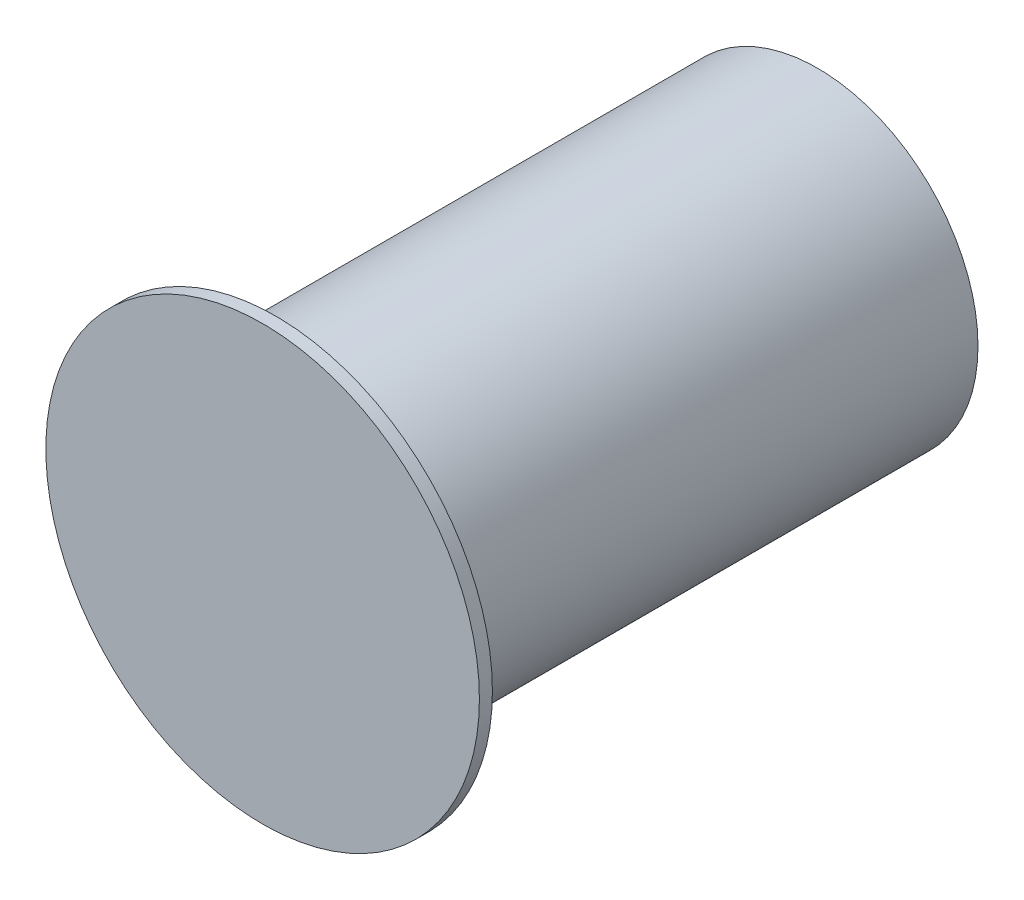
ISO-10303-21;
HEADER;
FILE_DESCRIPTION(('STEP AP214'),'2;1');
FILE_NAME('part.step','',(''),(''),'','','');
FILE_SCHEMA(('AUTOMOTIVE_DESIGN { 1 0 10303 214 1 1 1 1 }'));
ENDSEC;
DATA;
#1=APPLICATION_CONTEXT('core data for automotive mechanical design processes');
#2=APPLICATION_PROTOCOL_DEFINITION('international standard','automotive_design',2000,#1);
#3=PRODUCT_CONTEXT('',#1,'mechanical');
#4=PRODUCT('Part','Part','',(#3));
#5=PRODUCT_RELATED_PRODUCT_CATEGORY('part','',(#4));
#6=PRODUCT_DEFINITION_FORMATION('','',#4);
#7=PRODUCT_DEFINITION_CONTEXT('part definition',#1,'design');
#8=PRODUCT_DEFINITION('design','',#6,#7);
#9=PRODUCT_DEFINITION_SHAPE('','',#8);
#10=(LENGTH_UNIT() NAMED_UNIT(*) SI_UNIT(.MILLI.,.METRE.));
#11=(NAMED_UNIT(*) PLANE_ANGLE_UNIT() SI_UNIT($,.RADIAN.));
#12=(NAMED_UNIT(*) SI_UNIT($,.STERADIAN.) SOLID_ANGLE_UNIT());
#13=UNCERTAINTY_MEASURE_WITH_UNIT(LENGTH_MEASURE(1.E-05),#10,'distance_accuracy_value','');
#14=(GEOMETRIC_REPRESENTATION_CONTEXT(3) GLOBAL_UNCERTAINTY_ASSIGNED_CONTEXT((#13)) GLOBAL_UNIT_ASSIGNED_CONTEXT((#10,
#11,#12)) REPRESENTATION_CONTEXT('',''));
#15=CARTESIAN_POINT('',(0.,0.,0.));
#16=DIRECTION('',(0.,0.,1.));
#17=DIRECTION('',(1.,0.,0.));
#18=AXIS2_PLACEMENT_3D('',#15,#16,#17);
#19=CARTESIAN_POINT('',(0.,0.,-20.5));
#20=DIRECTION('',(0.,0.,-1.));
#21=DIRECTION('',(-1.,0.,0.));
#22=AXIS2_PLACEMENT_3D('',#19,#20,#21);
#23=PLANE('',#22);
#24=DIRECTION('',(0.,-1.,0.));
#25=VECTOR('',#24,1.);
#26=CARTESIAN_POINT('',(2.,2.23606797749979,-20.5));
#27=LINE('',#26,#25);
#28=CARTESIAN_POINT('',(2.,2.23606797749979,-20.5));
#29=VERTEX_POINT('',#28);
#30=CARTESIAN_POINT('',(2.,-2.23606797749979,-20.5));
#31=VERTEX_POINT('',#30);
#32=EDGE_CURVE('E88',#29,#31,#27,.T.);
#33=ORIENTED_EDGE('',*,*,#32,.F.);
#34=CARTESIAN_POINT('',(0.,0.,-20.5));
#35=DIRECTION('',(0.,0.,-1.));
#36=DIRECTION('',(-1.,0.,0.));
#37=AXIS2_PLACEMENT_3D('',#34,#35,#36);
#38=CIRCLE('',#37,3.);
#39=EDGE_CURVE('E115',#29,#31,#38,.T.);
#40=ORIENTED_EDGE('',*,*,#39,.T.);
#41=EDGE_LOOP('',(#33,#40));
#42=FACE_BOUND('',#41,.T.);
#43=ADVANCED_FACE('F35',(#42),#23,.T.);
#44=CARTESIAN_POINT('',(0.,0.,0.6));
#45=DIRECTION('',(0.,0.,-1.));
#46=DIRECTION('',(-1.,0.,0.));
#47=AXIS2_PLACEMENT_3D('',#44,#45,#46);
#48=CYLINDRICAL_SURFACE('',#47,9.99999999999999);
#49=CARTESIAN_POINT('',(0.,0.,0.6));
#50=DIRECTION('',(0.,0.,1.));
#51=DIRECTION('',(1.,0.,0.));
#52=AXIS2_PLACEMENT_3D('',#49,#50,#51);
#53=CIRCLE('',#52,9.99999999999999);
#54=CARTESIAN_POINT('',(9.99999999999999,0.,0.6));
#55=VERTEX_POINT('',#54);
#56=EDGE_CURVE('E44',#55,#55,#53,.T.);
#57=ORIENTED_EDGE('',*,*,#56,.F.);
#58=EDGE_LOOP('',(#57));
#59=FACE_BOUND('',#58,.T.);
#60=CARTESIAN_POINT('',(0.,0.,0.));
#61=DIRECTION('',(0.,0.,1.));
#62=DIRECTION('',(1.,0.,0.));
#63=AXIS2_PLACEMENT_3D('',#60,#61,#62);
#64=CIRCLE('',#63,9.99999999999999);
#65=CARTESIAN_POINT('',(9.99999999999999,0.,0.));
#66=VERTEX_POINT('',#65);
#67=EDGE_CURVE('E39',#66,#66,#64,.T.);
#68=ORIENTED_EDGE('',*,*,#67,.T.);
#69=EDGE_LOOP('',(#68));
#70=FACE_BOUND('',#69,.T.);
#71=ADVANCED_FACE('F37',(#59,#70),#48,.T.);
#72=CARTESIAN_POINT('',(0.,0.,0.6));
#73=DIRECTION('',(0.,0.,1.));
#74=DIRECTION('',(1.,0.,0.));
#75=AXIS2_PLACEMENT_3D('',#72,#73,#74);
#76=PLANE('',#75);
#77=ORIENTED_EDGE('',*,*,#56,.T.);
#78=EDGE_LOOP('',(#77));
#79=FACE_BOUND('',#78,.T.);
#80=ADVANCED_FACE('F136',(#79),#76,.T.);
#81=CARTESIAN_POINT('',(0.,0.,0.));
#82=DIRECTION('',(0.,0.,1.));
#83=DIRECTION('',(1.,0.,0.));
#84=AXIS2_PLACEMENT_3D('',#81,#82,#83);
#85=PLANE('',#84);
#86=CARTESIAN_POINT('',(0.,0.,0.));
#87=DIRECTION('',(0.,0.,-1.));
#88=DIRECTION('',(-1.,0.,0.));
#89=AXIS2_PLACEMENT_3D('',#86,#87,#88);
#90=CIRCLE('',#89,7.4);
#91=CARTESIAN_POINT('',(-7.4,0.,0.));
#92=VERTEX_POINT('',#91);
#93=EDGE_CURVE('E11',#92,#92,#90,.T.);
#94=ORIENTED_EDGE('',*,*,#93,.F.);
#95=EDGE_LOOP('',(#94));
#96=FACE_BOUND('',#95,.T.);
#97=ORIENTED_EDGE('',*,*,#67,.F.);
#98=EDGE_LOOP('',(#97));
#99=FACE_BOUND('',#98,.T.);
#100=ADVANCED_FACE('F133',(#96,#99),#85,.F.);
#101=CARTESIAN_POINT('',(0.,0.,-25.));
#102=DIRECTION('',(0.,0.,1.));
#103=DIRECTION('',(1.,0.,0.));
#104=AXIS2_PLACEMENT_3D('',#101,#102,#103);
#105=CYLINDRICAL_SURFACE('',#104,7.4);
#106=CARTESIAN_POINT('',(0.,0.,-25.));
#107=DIRECTION('',(0.,0.,-1.));
#108=DIRECTION('',(-1.,0.,0.));
#109=AXIS2_PLACEMENT_3D('',#106,#107,#108);
#110=CIRCLE('',#109,7.4);
#111=CARTESIAN_POINT('',(-7.4,0.,-25.));
#112=VERTEX_POINT('',#111);
#113=EDGE_CURVE('E121',#112,#112,#110,.T.);
#114=ORIENTED_EDGE('',*,*,#113,.F.);
#115=EDGE_LOOP('',(#114));
#116=FACE_BOUND('',#115,.T.);
#117=ORIENTED_EDGE('',*,*,#93,.T.);
#118=EDGE_LOOP('',(#117));
#119=FACE_BOUND('',#118,.T.);
#120=ADVANCED_FACE('F135',(#116,#119),#105,.T.);
#121=CARTESIAN_POINT('',(0.,0.,-25.));
#122=DIRECTION('',(0.,0.,-1.));
#123=DIRECTION('',(-1.,0.,0.));
#124=AXIS2_PLACEMENT_3D('',#121,#122,#123);
#125=PLANE('',#124);
#126=CARTESIAN_POINT('',(0.,0.,-25.));
#127=DIRECTION('',(0.,0.,-1.));
#128=DIRECTION('',(-1.,0.,0.));
#129=AXIS2_PLACEMENT_3D('',#126,#127,#128);
#130=CIRCLE('',#129,5.);
#131=CARTESIAN_POINT('',(-5.,0.,-25.));
#132=VERTEX_POINT('',#131);
#133=EDGE_CURVE('E122',#132,#132,#130,.T.);
#134=ORIENTED_EDGE('',*,*,#133,.F.);
#135=EDGE_LOOP('',(#134));
#136=FACE_BOUND('',#135,.T.);
#137=ORIENTED_EDGE('',*,*,#113,.T.);
#138=EDGE_LOOP('',(#137));
#139=FACE_BOUND('',#138,.T.);
#140=ADVANCED_FACE('F143',(#136,#139),#125,.T.);
#141=CARTESIAN_POINT('',(0.,0.,-23.));
#142=DIRECTION('',(0.,0.,-1.));
#143=DIRECTION('',(-1.,0.,0.));
#144=AXIS2_PLACEMENT_3D('',#141,#142,#143);
#145=CYLINDRICAL_SURFACE('',#144,5.);
#146=CARTESIAN_POINT('',(0.,0.,-23.));
#147=DIRECTION('',(0.,0.,-1.));
#148=DIRECTION('',(-1.,0.,0.));
#149=AXIS2_PLACEMENT_3D('',#146,#147,#148);
#150=CIRCLE('',#149,5.);
#151=CARTESIAN_POINT('',(-5.,0.,-23.));
#152=VERTEX_POINT('',#151);
#153=EDGE_CURVE('E118',#152,#152,#150,.T.);
#154=ORIENTED_EDGE('',*,*,#153,.F.);
#155=EDGE_LOOP('',(#154));
#156=FACE_BOUND('',#155,.T.);
#157=ORIENTED_EDGE('',*,*,#133,.T.);
#158=EDGE_LOOP('',(#157));
#159=FACE_BOUND('',#158,.T.);
#160=ADVANCED_FACE('F171',(#156,#159),#145,.F.);
#161=CARTESIAN_POINT('',(0.,0.,-23.));
#162=DIRECTION('',(0.,0.,-1.));
#163=DIRECTION('',(-1.,0.,0.));
#164=AXIS2_PLACEMENT_3D('',#161,#162,#163);
#165=PLANE('',#164);
#166=CARTESIAN_POINT('',(0.,0.,-23.));
#167=DIRECTION('',(0.,0.,-1.));
#168=DIRECTION('',(-1.,0.,0.));
#169=AXIS2_PLACEMENT_3D('',#166,#167,#168);
#170=CIRCLE('',#169,3.);
#171=CARTESIAN_POINT('',(-3.,0.,-23.));
#172=VERTEX_POINT('',#171);
#173=EDGE_CURVE('E109',#172,#172,#170,.T.);
#174=ORIENTED_EDGE('',*,*,#173,.F.);
#175=EDGE_LOOP('',(#174));
#176=FACE_BOUND('',#175,.T.);
#177=ORIENTED_EDGE('',*,*,#153,.T.);
#178=EDGE_LOOP('',(#177));
#179=FACE_BOUND('',#178,.T.);
#180=ADVANCED_FACE('F167',(#176,#179),#165,.T.);
#181=CARTESIAN_POINT('',(0.,0.,-20.5));
#182=DIRECTION('',(0.,0.,-1.));
#183=DIRECTION('',(-1.,0.,0.));
#184=AXIS2_PLACEMENT_3D('',#181,#182,#183);
#185=CYLINDRICAL_SURFACE('',#184,3.);
#186=ORIENTED_EDGE('',*,*,#39,.F.);
#187=DIRECTION('',(0.,0.,-1.));
#188=VECTOR('',#187,1.);
#189=CARTESIAN_POINT('',(2.,2.23606797749979,-13.5));
#190=LINE('',#189,#188);
#191=CARTESIAN_POINT('',(2.,2.23606797749979,-13.5));
#192=VERTEX_POINT('',#191);
#193=EDGE_CURVE('E76',#192,#29,#190,.T.);
#194=ORIENTED_EDGE('',*,*,#193,.F.);
#195=CARTESIAN_POINT('',(0.,0.,-13.5));
#196=DIRECTION('',(0.,0.,-1.));
#197=DIRECTION('',(-1.,0.,0.));
#198=AXIS2_PLACEMENT_3D('',#195,#196,#197);
#199=CIRCLE('',#198,3.);
#200=CARTESIAN_POINT('',(-2.,2.23606797749979,-13.5));
#201=VERTEX_POINT('',#200);
#202=EDGE_CURVE('E100',#201,#192,#199,.T.);
#203=ORIENTED_EDGE('',*,*,#202,.F.);
#204=DIRECTION('',(0.,0.,-1.));
#205=VECTOR('',#204,1.);
#206=CARTESIAN_POINT('',(-2.,2.23606797749979,-13.5));
#207=LINE('',#206,#205);
#208=CARTESIAN_POINT('',(-2.,2.23606797749979,-20.5));
#209=VERTEX_POINT('',#208);
#210=EDGE_CURVE('E58',#201,#209,#207,.T.);
#211=ORIENTED_EDGE('',*,*,#210,.T.);
#212=CARTESIAN_POINT('',(-2.,-2.23606797749979,-20.5));
#213=VERTEX_POINT('',#212);
#214=EDGE_CURVE('E112',#213,#209,#38,.T.);
#215=ORIENTED_EDGE('',*,*,#214,.F.);
#216=DIRECTION('',(0.,0.,-1.));
#217=VECTOR('',#216,1.);
#218=CARTESIAN_POINT('',(-2.,-2.23606797749979,-13.5));
#219=LINE('',#218,#217);
#220=CARTESIAN_POINT('',(-2.,-2.23606797749979,-13.5));
#221=VERTEX_POINT('',#220);
#222=EDGE_CURVE('E52',#221,#213,#219,.T.);
#223=ORIENTED_EDGE('',*,*,#222,.F.);
#224=CARTESIAN_POINT('',(0.,0.,-13.5));
#225=DIRECTION('',(0.,0.,-1.));
#226=DIRECTION('',(-1.,0.,0.));
#227=AXIS2_PLACEMENT_3D('',#224,#225,#226);
#228=CIRCLE('',#227,3.);
#229=CARTESIAN_POINT('',(2.,-2.23606797749979,-13.5));
#230=VERTEX_POINT('',#229);
#231=EDGE_CURVE('E92',#230,#221,#228,.T.);
#232=ORIENTED_EDGE('',*,*,#231,.F.);
#233=DIRECTION('',(0.,0.,-1.));
#234=VECTOR('',#233,1.);
#235=CARTESIAN_POINT('',(2.,-2.23606797749979,-13.5));
#236=LINE('',#235,#234);
#237=EDGE_CURVE('E81',#230,#31,#236,.T.);
#238=ORIENTED_EDGE('',*,*,#237,.T.);
#239=EDGE_LOOP('',(#186,#194,#203,#211,#215,#223,#232,#238));
#240=FACE_BOUND('',#239,.T.);
#241=ORIENTED_EDGE('',*,*,#173,.T.);
#242=EDGE_LOOP('',(#241));
#243=FACE_BOUND('',#242,.T.);
#244=ADVANCED_FACE('F93',(#240,#243),#185,.F.);
#245=DIRECTION('',(0.,1.,0.));
#246=VECTOR('',#245,1.);
#247=CARTESIAN_POINT('',(-2.,2.23606797749979,-20.5));
#248=LINE('',#247,#246);
#249=EDGE_CURVE('E102',#213,#209,#248,.T.);
#250=ORIENTED_EDGE('',*,*,#249,.F.);
#251=ORIENTED_EDGE('',*,*,#214,.T.);
#252=EDGE_LOOP('',(#250,#251));
#253=FACE_BOUND('',#252,.T.);
#254=ADVANCED_FACE('F152',(#253),#23,.T.);
#255=CARTESIAN_POINT('',(-2.,2.23606797749979,-13.5));
#256=DIRECTION('',(-1.,0.,0.));
#257=DIRECTION('',(0.,0.,1.));
#258=AXIS2_PLACEMENT_3D('',#255,#256,#257);
#259=PLANE('',#258);
#260=ORIENTED_EDGE('',*,*,#249,.T.);
#261=ORIENTED_EDGE('',*,*,#210,.F.);
#262=DIRECTION('',(0.,1.,0.));
#263=VECTOR('',#262,1.);
#264=CARTESIAN_POINT('',(-2.,2.23606797749979,-13.5));
#265=LINE('',#264,#263);
#266=EDGE_CURVE('E97',#221,#201,#265,.T.);
#267=ORIENTED_EDGE('',*,*,#266,.F.);
#268=ORIENTED_EDGE('',*,*,#222,.T.);
#269=EDGE_LOOP('',(#260,#261,#267,#268));
#270=FACE_BOUND('',#269,.T.);
#271=ADVANCED_FACE('F160',(#270),#259,.F.);
#272=CARTESIAN_POINT('',(2.,2.23606797749979,-13.5));
#273=DIRECTION('',(1.,0.,0.));
#274=DIRECTION('',(0.,0.,-1.));
#275=AXIS2_PLACEMENT_3D('',#272,#273,#274);
#276=PLANE('',#275);
#277=ORIENTED_EDGE('',*,*,#32,.T.);
#278=ORIENTED_EDGE('',*,*,#237,.F.);
#279=DIRECTION('',(0.,-1.,0.));
#280=VECTOR('',#279,1.);
#281=CARTESIAN_POINT('',(2.,2.23606797749979,-13.5));
#282=LINE('',#281,#280);
#283=EDGE_CURVE('E85',#192,#230,#282,.T.);
#284=ORIENTED_EDGE('',*,*,#283,.F.);
#285=ORIENTED_EDGE('',*,*,#193,.T.);
#286=EDGE_LOOP('',(#277,#278,#284,#285));
#287=FACE_BOUND('',#286,.T.);
#288=ADVANCED_FACE('F83',(#287),#276,.F.);
#289=CARTESIAN_POINT('',(0.,0.,-13.5));
#290=DIRECTION('',(0.,0.,-1.));
#291=DIRECTION('',(-1.,0.,0.));
#292=AXIS2_PLACEMENT_3D('',#289,#290,#291);
#293=PLANE('',#292);
#294=ORIENTED_EDGE('',*,*,#202,.T.);
#295=ORIENTED_EDGE('',*,*,#283,.T.);
#296=ORIENTED_EDGE('',*,*,#231,.T.);
#297=ORIENTED_EDGE('',*,*,#266,.T.);
#298=EDGE_LOOP('',(#294,#295,#296,#297));
#299=FACE_BOUND('',#298,.T.);
#300=ADVANCED_FACE('F99',(#299),#293,.T.);
#301=CLOSED_SHELL('',(#43,#71,#80,#100,#120,#140,#160,#180,#244,#254,#271,#288,#300));
#302=MANIFOLD_SOLID_BREP('B2',#301);
#303=ADVANCED_BREP_SHAPE_REPRESENTATION('',(#18,#302),#14);
#304=SHAPE_DEFINITION_REPRESENTATION(#9,#303);
ENDSEC;
END-ISO-10303-21;
